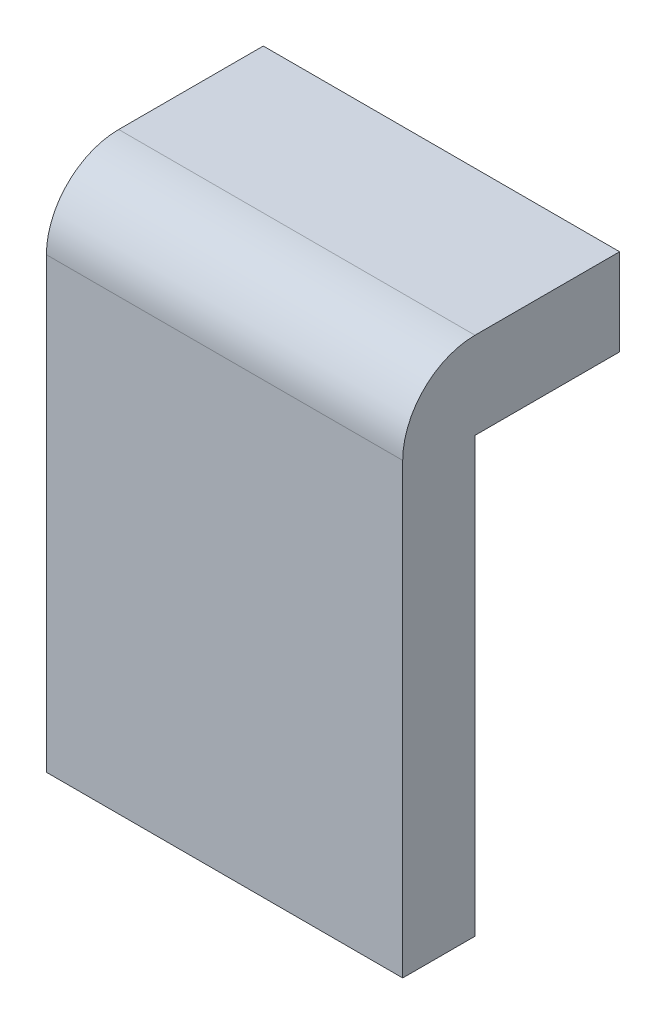
ISO-10303-21;
HEADER;
FILE_DESCRIPTION(('STEP AP214'),'2;1');
FILE_NAME('part.step','',(''),(''),'','','');
FILE_SCHEMA(('AUTOMOTIVE_DESIGN { 1 0 10303 214 1 1 1 1 }'));
ENDSEC;
DATA;
#1=APPLICATION_CONTEXT('core data for automotive mechanical design processes');
#2=APPLICATION_PROTOCOL_DEFINITION('international standard','automotive_design',2000,#1);
#3=PRODUCT_CONTEXT('',#1,'mechanical');
#4=PRODUCT('Part','Part','',(#3));
#5=PRODUCT_RELATED_PRODUCT_CATEGORY('part','',(#4));
#6=PRODUCT_DEFINITION_FORMATION('','',#4);
#7=PRODUCT_DEFINITION_CONTEXT('part definition',#1,'design');
#8=PRODUCT_DEFINITION('design','',#6,#7);
#9=PRODUCT_DEFINITION_SHAPE('','',#8);
#10=(LENGTH_UNIT() NAMED_UNIT(*) SI_UNIT(.MILLI.,.METRE.));
#11=(NAMED_UNIT(*) PLANE_ANGLE_UNIT() SI_UNIT($,.RADIAN.));
#12=(NAMED_UNIT(*) SI_UNIT($,.STERADIAN.) SOLID_ANGLE_UNIT());
#13=UNCERTAINTY_MEASURE_WITH_UNIT(LENGTH_MEASURE(1.E-05),#10,'distance_accuracy_value','');
#14=(GEOMETRIC_REPRESENTATION_CONTEXT(3) GLOBAL_UNCERTAINTY_ASSIGNED_CONTEXT((#13)) GLOBAL_UNIT_ASSIGNED_CONTEXT((#10,
#11,#12)) REPRESENTATION_CONTEXT('',''));
#15=CARTESIAN_POINT('',(0.,0.,0.));
#16=DIRECTION('',(0.,0.,1.));
#17=DIRECTION('',(1.,0.,0.));
#18=AXIS2_PLACEMENT_3D('',#15,#16,#17);
#19=CARTESIAN_POINT('',(-8.34906661620967,8.30000000000001,12.2546737770755));
#20=DIRECTION('',(0.,0.,1.));
#21=DIRECTION('',(0.,-1.,0.));
#22=AXIS2_PLACEMENT_3D('',#19,#20,#21);
#23=PLANE('',#22);
#24=DIRECTION('',(1.,0.,0.));
#25=VECTOR('',#24,1.);
#26=CARTESIAN_POINT('',(-15.8147962412963,6.80000000000003,12.2546737770755));
#27=LINE('',#26,#25);
#28=CARTESIAN_POINT('',(-3.38158711942134,6.80000000000003,12.2546737770755));
#29=VERTEX_POINT('',#28);
#30=CARTESIAN_POINT('',(-2.14943636298061,6.80000000000003,12.2546737770755));
#31=VERTEX_POINT('',#30);
#32=EDGE_CURVE('E113',#29,#31,#27,.T.);
#33=ORIENTED_EDGE('',*,*,#32,.F.);
#34=DIRECTION('',(0.,1.,0.));
#35=VECTOR('',#34,1.);
#36=CARTESIAN_POINT('',(-3.38158711942134,5.35753839337147,12.2546737770755));
#37=LINE('',#36,#35);
#38=CARTESIAN_POINT('',(-3.38158711942134,8.30000000000001,12.2546737770755));
#39=VERTEX_POINT('',#38);
#40=EDGE_CURVE('E148',#39,#29,#37,.F.);
#41=ORIENTED_EDGE('',*,*,#40,.F.);
#42=DIRECTION('',(1.,0.,0.));
#43=VECTOR('',#42,1.);
#44=CARTESIAN_POINT('',(-8.34906661620967,8.30000000000001,12.2546737770755));
#45=LINE('',#44,#43);
#46=CARTESIAN_POINT('',(-2.14943636298061,8.30000000000001,12.2546737770755));
#47=VERTEX_POINT('',#46);
#48=EDGE_CURVE('E133',#39,#47,#45,.T.);
#49=ORIENTED_EDGE('',*,*,#48,.T.);
#50=DIRECTION('',(0.,1.,0.));
#51=VECTOR('',#50,1.);
#52=CARTESIAN_POINT('',(-2.14943636298061,5.35753839337147,12.2546737770755));
#53=LINE('',#52,#51);
#54=EDGE_CURVE('E105',#31,#47,#53,.T.);
#55=ORIENTED_EDGE('',*,*,#54,.F.);
#56=EDGE_LOOP('',(#33,#41,#49,#55));
#57=FACE_BOUND('',#56,.T.);
#58=ADVANCED_FACE('F17',(#57),#23,.F.);
#59=CARTESIAN_POINT('',(-8.34906661620967,8.30000000000001,11.7546737770755));
#60=DIRECTION('',(0.,1.,0.));
#61=DIRECTION('',(0.,0.,1.));
#62=AXIS2_PLACEMENT_3D('',#59,#60,#61);
#63=PLANE('',#62);
#64=ORIENTED_EDGE('',*,*,#48,.F.);
#65=DIRECTION('',(0.,0.,1.));
#66=VECTOR('',#65,1.);
#67=CARTESIAN_POINT('',(-3.38158711942134,8.30000000000001,12.5046737770755));
#68=LINE('',#67,#66);
#69=CARTESIAN_POINT('',(-3.38158711942134,8.30000000000001,11.7546737770755));
#70=VERTEX_POINT('',#69);
#71=EDGE_CURVE('E153',#70,#39,#68,.T.);
#72=ORIENTED_EDGE('',*,*,#71,.F.);
#73=DIRECTION('',(1.,0.,0.));
#74=VECTOR('',#73,1.);
#75=CARTESIAN_POINT('',(-3.38158711942134,8.30000000000001,11.7546737770755));
#76=LINE('',#75,#74);
#77=CARTESIAN_POINT('',(-2.14943636298061,8.30000000000001,11.7546737770755));
#78=VERTEX_POINT('',#77);
#79=EDGE_CURVE('E124',#78,#70,#76,.F.);
#80=ORIENTED_EDGE('',*,*,#79,.F.);
#81=DIRECTION('',(0.,0.,-1.));
#82=VECTOR('',#81,1.);
#83=CARTESIAN_POINT('',(-2.14943636298061,8.30000000000001,12.5046737770755));
#84=LINE('',#83,#82);
#85=EDGE_CURVE('E129',#47,#78,#84,.T.);
#86=ORIENTED_EDGE('',*,*,#85,.F.);
#87=EDGE_LOOP('',(#64,#72,#80,#86));
#88=FACE_BOUND('',#87,.T.);
#89=ADVANCED_FACE('F175',(#88),#63,.F.);
#90=CARTESIAN_POINT('',(-3.38158711942134,5.35753839337146,11.7546737770755));
#91=DIRECTION('',(0.,0.,-1.));
#92=DIRECTION('',(0.,1.,0.));
#93=AXIS2_PLACEMENT_3D('',#90,#91,#92);
#94=PLANE('',#93);
#95=ORIENTED_EDGE('',*,*,#79,.T.);
#96=DIRECTION('',(0.,1.,0.));
#97=VECTOR('',#96,1.);
#98=CARTESIAN_POINT('',(-3.38158711942134,5.35753839337147,11.7546737770755));
#99=LINE('',#98,#97);
#100=CARTESIAN_POINT('',(-3.38158711942134,8.6,11.7546737770755));
#101=VERTEX_POINT('',#100);
#102=EDGE_CURVE('E119',#101,#70,#99,.F.);
#103=ORIENTED_EDGE('',*,*,#102,.F.);
#104=DIRECTION('',(1.,0.,0.));
#105=VECTOR('',#104,1.);
#106=CARTESIAN_POINT('',(-8.34906661620967,8.6,11.7546737770755));
#107=LINE('',#106,#105);
#108=CARTESIAN_POINT('',(-2.14943636298061,8.6,11.7546737770755));
#109=VERTEX_POINT('',#108);
#110=EDGE_CURVE('E122',#101,#109,#107,.T.);
#111=ORIENTED_EDGE('',*,*,#110,.T.);
#112=DIRECTION('',(0.,1.,0.));
#113=VECTOR('',#112,1.);
#114=CARTESIAN_POINT('',(-2.14943636298061,5.35753839337147,11.7546737770755));
#115=LINE('',#114,#113);
#116=EDGE_CURVE('E97',#78,#109,#115,.T.);
#117=ORIENTED_EDGE('',*,*,#116,.F.);
#118=EDGE_LOOP('',(#95,#103,#111,#117));
#119=FACE_BOUND('',#118,.T.);
#120=ADVANCED_FACE('F172',(#119),#94,.T.);
#121=CARTESIAN_POINT('',(-8.34906661620967,8.6,11.7546737770755));
#122=DIRECTION('',(0.,-1.,0.));
#123=DIRECTION('',(0.,0.,-1.));
#124=AXIS2_PLACEMENT_3D('',#121,#122,#123);
#125=PLANE('',#124);
#126=ORIENTED_EDGE('',*,*,#110,.F.);
#127=DIRECTION('',(0.,0.,1.));
#128=VECTOR('',#127,1.);
#129=CARTESIAN_POINT('',(-3.38158711942134,8.6,12.5046737770755));
#130=LINE('',#129,#128);
#131=CARTESIAN_POINT('',(-3.38158711942134,8.6,12.2546737770755));
#132=VERTEX_POINT('',#131);
#133=EDGE_CURVE('E83',#132,#101,#130,.F.);
#134=ORIENTED_EDGE('',*,*,#133,.F.);
#135=DIRECTION('',(1.,0.,0.));
#136=VECTOR('',#135,1.);
#137=CARTESIAN_POINT('',(-8.34906661620967,8.6,12.2546737770755));
#138=LINE('',#137,#136);
#139=CARTESIAN_POINT('',(-2.14943636298061,8.6,12.2546737770755));
#140=VERTEX_POINT('',#139);
#141=EDGE_CURVE('E79',#140,#132,#138,.F.);
#142=ORIENTED_EDGE('',*,*,#141,.F.);
#143=DIRECTION('',(0.,0.,-1.));
#144=VECTOR('',#143,1.);
#145=CARTESIAN_POINT('',(-2.14943636298061,8.6,12.5046737770755));
#146=LINE('',#145,#144);
#147=EDGE_CURVE('E94',#109,#140,#146,.F.);
#148=ORIENTED_EDGE('',*,*,#147,.F.);
#149=EDGE_LOOP('',(#126,#134,#142,#148));
#150=FACE_BOUND('',#149,.T.);
#151=ADVANCED_FACE('F168',(#150),#125,.F.);
#152=CARTESIAN_POINT('',(-8.34906661620967,8.35,12.2546737770755));
#153=DIRECTION('',(1.,0.,0.));
#154=DIRECTION('',(0.,0.,-1.));
#155=AXIS2_PLACEMENT_3D('',#152,#153,#154);
#156=CYLINDRICAL_SURFACE('',#155,0.249999999999995);
#157=CARTESIAN_POINT('',(-3.38158711942134,8.35,12.2546737770755));
#158=DIRECTION('',(1.,0.,0.));
#159=DIRECTION('',(0.,0.,-1.));
#160=AXIS2_PLACEMENT_3D('',#157,#158,#159);
#161=CIRCLE('',#160,0.249999999999995);
#162=CARTESIAN_POINT('',(-3.38158711942134,8.35,12.5046737770755));
#163=VERTEX_POINT('',#162);
#164=EDGE_CURVE('E20',#163,#132,#161,.F.);
#165=ORIENTED_EDGE('',*,*,#164,.F.);
#166=DIRECTION('',(1.,0.,0.));
#167=VECTOR('',#166,1.);
#168=CARTESIAN_POINT('',(-3.38158711942134,8.35,12.5046737770755));
#169=LINE('',#168,#167);
#170=CARTESIAN_POINT('',(-2.14943636298061,8.35,12.5046737770755));
#171=VERTEX_POINT('',#170);
#172=EDGE_CURVE('E77',#171,#163,#169,.F.);
#173=ORIENTED_EDGE('',*,*,#172,.F.);
#174=CARTESIAN_POINT('',(-2.14943636298061,8.35,12.2546737770755));
#175=DIRECTION('',(1.,0.,0.));
#176=DIRECTION('',(0.,0.,-1.));
#177=AXIS2_PLACEMENT_3D('',#174,#175,#176);
#178=CIRCLE('',#177,0.249999999999995);
#179=EDGE_CURVE('E106',#140,#171,#178,.T.);
#180=ORIENTED_EDGE('',*,*,#179,.F.);
#181=ORIENTED_EDGE('',*,*,#141,.T.);
#182=EDGE_LOOP('',(#165,#173,#180,#181));
#183=FACE_BOUND('',#182,.T.);
#184=ADVANCED_FACE('F74',(#183),#156,.T.);
#185=CARTESIAN_POINT('',(-3.38158711942134,5.35753839337147,12.5046737770755));
#186=DIRECTION('',(-1.,0.,0.));
#187=DIRECTION('',(0.,0.,1.));
#188=AXIS2_PLACEMENT_3D('',#185,#186,#187);
#189=PLANE('',#188);
#190=DIRECTION('',(0.,0.,-1.));
#191=VECTOR('',#190,1.);
#192=CARTESIAN_POINT('',(-3.38158711942134,6.80000000000003,12.5046737770755));
#193=LINE('',#192,#191);
#194=CARTESIAN_POINT('',(-3.38158711942134,6.80000000000003,12.5046737770755));
#195=VERTEX_POINT('',#194);
#196=EDGE_CURVE('E89',#195,#29,#193,.T.);
#197=ORIENTED_EDGE('',*,*,#196,.F.);
#198=DIRECTION('',(0.,-1.,0.));
#199=VECTOR('',#198,1.);
#200=CARTESIAN_POINT('',(-3.38158711942134,5.35753839337147,12.5046737770755));
#201=LINE('',#200,#199);
#202=EDGE_CURVE('E85',#163,#195,#201,.T.);
#203=ORIENTED_EDGE('',*,*,#202,.F.);
#204=ORIENTED_EDGE('',*,*,#164,.T.);
#205=ORIENTED_EDGE('',*,*,#133,.T.);
#206=ORIENTED_EDGE('',*,*,#102,.T.);
#207=ORIENTED_EDGE('',*,*,#71,.T.);
#208=ORIENTED_EDGE('',*,*,#40,.T.);
#209=EDGE_LOOP('',(#197,#203,#204,#205,#206,#207,#208));
#210=FACE_BOUND('',#209,.T.);
#211=ADVANCED_FACE('F86',(#210),#189,.T.);
#212=CARTESIAN_POINT('',(-15.8147962412963,6.80000000000003,12.5046737770755));
#213=DIRECTION('',(0.,-1.,0.));
#214=DIRECTION('',(0.,0.,-1.));
#215=AXIS2_PLACEMENT_3D('',#212,#213,#214);
#216=PLANE('',#215);
#217=DIRECTION('',(1.,0.,0.));
#218=VECTOR('',#217,1.);
#219=CARTESIAN_POINT('',(-3.38158711942134,6.80000000000003,12.5046737770755));
#220=LINE('',#219,#218);
#221=CARTESIAN_POINT('',(-2.14943636298061,6.80000000000003,12.5046737770755));
#222=VERTEX_POINT('',#221);
#223=EDGE_CURVE('E26',#195,#222,#220,.T.);
#224=ORIENTED_EDGE('',*,*,#223,.F.);
#225=ORIENTED_EDGE('',*,*,#196,.T.);
#226=ORIENTED_EDGE('',*,*,#32,.T.);
#227=DIRECTION('',(0.,0.,-1.));
#228=VECTOR('',#227,1.);
#229=CARTESIAN_POINT('',(-2.14943636298061,6.80000000000003,12.5046737770755));
#230=LINE('',#229,#228);
#231=EDGE_CURVE('E35',#222,#31,#230,.T.);
#232=ORIENTED_EDGE('',*,*,#231,.F.);
#233=EDGE_LOOP('',(#224,#225,#226,#232));
#234=FACE_BOUND('',#233,.T.);
#235=ADVANCED_FACE('F179',(#234),#216,.T.);
#236=CARTESIAN_POINT('',(-2.14943636298061,5.35753839337147,12.5046737770755));
#237=DIRECTION('',(1.,0.,0.));
#238=DIRECTION('',(0.,0.,-1.));
#239=AXIS2_PLACEMENT_3D('',#236,#237,#238);
#240=PLANE('',#239);
#241=ORIENTED_EDGE('',*,*,#116,.T.);
#242=ORIENTED_EDGE('',*,*,#147,.T.);
#243=ORIENTED_EDGE('',*,*,#179,.T.);
#244=DIRECTION('',(0.,-1.,0.));
#245=VECTOR('',#244,1.);
#246=CARTESIAN_POINT('',(-2.14943636298061,5.35753839337147,12.5046737770755));
#247=LINE('',#246,#245);
#248=EDGE_CURVE('E11',#222,#171,#247,.F.);
#249=ORIENTED_EDGE('',*,*,#248,.F.);
#250=ORIENTED_EDGE('',*,*,#231,.T.);
#251=ORIENTED_EDGE('',*,*,#54,.T.);
#252=ORIENTED_EDGE('',*,*,#85,.T.);
#253=EDGE_LOOP('',(#241,#242,#243,#249,#250,#251,#252));
#254=FACE_BOUND('',#253,.T.);
#255=ADVANCED_FACE('F164',(#254),#240,.T.);
#256=CARTESIAN_POINT('',(-3.38158711942134,5.35753839337147,12.5046737770755));
#257=DIRECTION('',(0.,0.,1.));
#258=DIRECTION('',(0.,-1.,0.));
#259=AXIS2_PLACEMENT_3D('',#256,#257,#258);
#260=PLANE('',#259);
#261=ORIENTED_EDGE('',*,*,#223,.T.);
#262=ORIENTED_EDGE('',*,*,#248,.T.);
#263=ORIENTED_EDGE('',*,*,#172,.T.);
#264=ORIENTED_EDGE('',*,*,#202,.T.);
#265=EDGE_LOOP('',(#261,#262,#263,#264));
#266=FACE_BOUND('',#265,.T.);
#267=ADVANCED_FACE('F93',(#266),#260,.T.);
#268=CLOSED_SHELL('',(#58,#89,#120,#151,#184,#211,#235,#255,#267));
#269=MANIFOLD_SOLID_BREP('B1',#268);
#270=ADVANCED_BREP_SHAPE_REPRESENTATION('',(#18,#269),#14);
#271=SHAPE_DEFINITION_REPRESENTATION(#9,#270);
ENDSEC;
END-ISO-10303-21;
